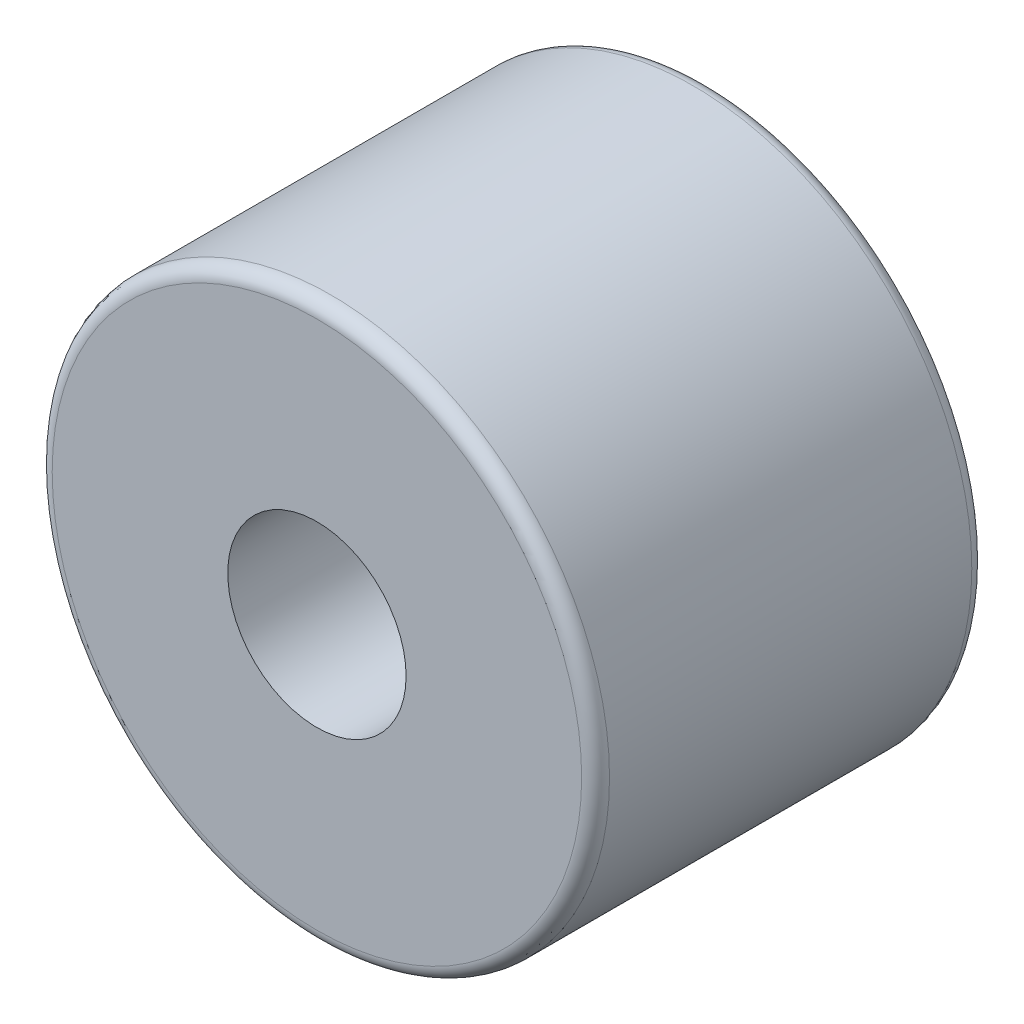
ISO-10303-21;
HEADER;
FILE_DESCRIPTION(('STEP AP214'),'2;1');
FILE_NAME('part.step','',(''),(''),'','','');
FILE_SCHEMA(('AUTOMOTIVE_DESIGN { 1 0 10303 214 1 1 1 1 }'));
ENDSEC;
DATA;
#1=APPLICATION_CONTEXT('core data for automotive mechanical design processes');
#2=APPLICATION_PROTOCOL_DEFINITION('international standard','automotive_design',2000,#1);
#3=PRODUCT_CONTEXT('',#1,'mechanical');
#4=PRODUCT('Part','Part','',(#3));
#5=PRODUCT_RELATED_PRODUCT_CATEGORY('part','',(#4));
#6=PRODUCT_DEFINITION_FORMATION('','',#4);
#7=PRODUCT_DEFINITION_CONTEXT('part definition',#1,'design');
#8=PRODUCT_DEFINITION('design','',#6,#7);
#9=PRODUCT_DEFINITION_SHAPE('','',#8);
#10=(LENGTH_UNIT() NAMED_UNIT(*) SI_UNIT(.MILLI.,.METRE.));
#11=(NAMED_UNIT(*) PLANE_ANGLE_UNIT() SI_UNIT($,.RADIAN.));
#12=(NAMED_UNIT(*) SI_UNIT($,.STERADIAN.) SOLID_ANGLE_UNIT());
#13=UNCERTAINTY_MEASURE_WITH_UNIT(LENGTH_MEASURE(1.E-05),#10,'distance_accuracy_value','');
#14=(GEOMETRIC_REPRESENTATION_CONTEXT(3) GLOBAL_UNCERTAINTY_ASSIGNED_CONTEXT((#13)) GLOBAL_UNIT_ASSIGNED_CONTEXT((#10,
#11,#12)) REPRESENTATION_CONTEXT('',''));
#15=CARTESIAN_POINT('',(0.,0.,0.));
#16=DIRECTION('',(0.,0.,1.));
#17=DIRECTION('',(1.,0.,0.));
#18=AXIS2_PLACEMENT_3D('',#15,#16,#17);
#19=CARTESIAN_POINT('',(0.,0.,7.));
#20=DIRECTION('',(0.,0.,1.));
#21=DIRECTION('',(1.,0.,0.));
#22=AXIS2_PLACEMENT_3D('',#19,#20,#21);
#23=PLANE('',#22);
#24=CARTESIAN_POINT('',(0.,0.,7.));
#25=DIRECTION('',(0.,0.,1.));
#26=DIRECTION('',(1.,0.,0.));
#27=AXIS2_PLACEMENT_3D('',#24,#25,#26);
#28=CIRCLE('',#27,4.75);
#29=CARTESIAN_POINT('',(4.75,0.,7.));
#30=VERTEX_POINT('',#29);
#31=EDGE_CURVE('E55',#30,#30,#28,.T.);
#32=ORIENTED_EDGE('',*,*,#31,.T.);
#33=EDGE_LOOP('',(#32));
#34=FACE_BOUND('',#33,.T.);
#35=CARTESIAN_POINT('',(0.,0.,7.));
#36=DIRECTION('',(0.,0.,1.));
#37=DIRECTION('',(1.,0.,0.));
#38=AXIS2_PLACEMENT_3D('',#35,#36,#37);
#39=CIRCLE('',#38,1.6);
#40=CARTESIAN_POINT('',(1.6,0.,7.));
#41=VERTEX_POINT('',#40);
#42=EDGE_CURVE('E60',#41,#41,#39,.T.);
#43=ORIENTED_EDGE('',*,*,#42,.F.);
#44=EDGE_LOOP('',(#43));
#45=FACE_BOUND('',#44,.T.);
#46=ADVANCED_FACE('F35',(#34,#45),#23,.T.);
#47=CARTESIAN_POINT('',(0.,0.,0.));
#48=DIRECTION('',(0.,0.,1.));
#49=DIRECTION('',(1.,0.,0.));
#50=AXIS2_PLACEMENT_3D('',#47,#48,#49);
#51=PLANE('',#50);
#52=CARTESIAN_POINT('',(0.,0.,0.));
#53=DIRECTION('',(0.,0.,1.));
#54=DIRECTION('',(1.,0.,0.));
#55=AXIS2_PLACEMENT_3D('',#52,#53,#54);
#56=CIRCLE('',#55,4.75);
#57=CARTESIAN_POINT('',(4.75,0.,0.));
#58=VERTEX_POINT('',#57);
#59=EDGE_CURVE('E10',#58,#58,#56,.F.);
#60=ORIENTED_EDGE('',*,*,#59,.T.);
#61=EDGE_LOOP('',(#60));
#62=FACE_BOUND('',#61,.T.);
#63=CARTESIAN_POINT('',(0.,0.,0.));
#64=DIRECTION('',(0.,0.,1.));
#65=DIRECTION('',(1.,0.,0.));
#66=AXIS2_PLACEMENT_3D('',#63,#64,#65);
#67=CIRCLE('',#66,1.6);
#68=CARTESIAN_POINT('',(1.6,0.,0.));
#69=VERTEX_POINT('',#68);
#70=EDGE_CURVE('E61',#69,#69,#67,.T.);
#71=ORIENTED_EDGE('',*,*,#70,.T.);
#72=EDGE_LOOP('',(#71));
#73=FACE_BOUND('',#72,.T.);
#74=ADVANCED_FACE('F72',(#62,#73),#51,.F.);
#75=CARTESIAN_POINT('',(0.,0.,7.));
#76=DIRECTION('',(0.,0.,-1.));
#77=DIRECTION('',(-1.,0.,0.));
#78=AXIS2_PLACEMENT_3D('',#75,#76,#77);
#79=CYLINDRICAL_SURFACE('',#78,5.);
#80=CARTESIAN_POINT('',(0.,0.,0.25));
#81=DIRECTION('',(0.,0.,1.));
#82=DIRECTION('',(1.,0.,0.));
#83=AXIS2_PLACEMENT_3D('',#80,#81,#82);
#84=CIRCLE('',#83,5.);
#85=CARTESIAN_POINT('',(5.,0.,0.25));
#86=VERTEX_POINT('',#85);
#87=EDGE_CURVE('E43',#86,#86,#84,.T.);
#88=ORIENTED_EDGE('',*,*,#87,.T.);
#89=EDGE_LOOP('',(#88));
#90=FACE_BOUND('',#89,.T.);
#91=CARTESIAN_POINT('',(0.,0.,6.75));
#92=DIRECTION('',(0.,0.,1.));
#93=DIRECTION('',(1.,0.,0.));
#94=AXIS2_PLACEMENT_3D('',#91,#92,#93);
#95=CIRCLE('',#94,5.);
#96=CARTESIAN_POINT('',(5.,0.,6.75));
#97=VERTEX_POINT('',#96);
#98=EDGE_CURVE('E49',#97,#97,#95,.F.);
#99=ORIENTED_EDGE('',*,*,#98,.T.);
#100=EDGE_LOOP('',(#99));
#101=FACE_BOUND('',#100,.T.);
#102=ADVANCED_FACE('F78',(#90,#101),#79,.T.);
#103=CARTESIAN_POINT('',(0.,0.,7.));
#104=DIRECTION('',(0.,0.,-1.));
#105=DIRECTION('',(-1.,0.,0.));
#106=AXIS2_PLACEMENT_3D('',#103,#104,#105);
#107=CYLINDRICAL_SURFACE('',#106,1.6);
#108=ORIENTED_EDGE('',*,*,#42,.T.);
#109=EDGE_LOOP('',(#108));
#110=FACE_BOUND('',#109,.T.);
#111=ORIENTED_EDGE('',*,*,#70,.F.);
#112=EDGE_LOOP('',(#111));
#113=FACE_BOUND('',#112,.T.);
#114=ADVANCED_FACE('F68',(#110,#113),#107,.F.);
#115=CARTESIAN_POINT('',(0.,0.,6.75));
#116=DIRECTION('',(0.,0.,1.));
#117=DIRECTION('',(1.,0.,0.));
#118=AXIS2_PLACEMENT_3D('',#115,#116,#117);
#119=TOROIDAL_SURFACE('',#118,4.75,0.25);
#120=ORIENTED_EDGE('',*,*,#98,.F.);
#121=EDGE_LOOP('',(#120));
#122=FACE_BOUND('',#121,.T.);
#123=ORIENTED_EDGE('',*,*,#31,.F.);
#124=EDGE_LOOP('',(#123));
#125=FACE_BOUND('',#124,.T.);
#126=ADVANCED_FACE('F83',(#122,#125),#119,.T.);
#127=CARTESIAN_POINT('',(0.,0.,0.25));
#128=DIRECTION('',(0.,0.,1.));
#129=DIRECTION('',(1.,0.,0.));
#130=AXIS2_PLACEMENT_3D('',#127,#128,#129);
#131=TOROIDAL_SURFACE('',#130,4.75,0.25);
#132=ORIENTED_EDGE('',*,*,#59,.F.);
#133=EDGE_LOOP('',(#132));
#134=FACE_BOUND('',#133,.T.);
#135=ORIENTED_EDGE('',*,*,#87,.F.);
#136=EDGE_LOOP('',(#135));
#137=FACE_BOUND('',#136,.T.);
#138=ADVANCED_FACE('F37',(#134,#137),#131,.T.);
#139=CLOSED_SHELL('',(#46,#74,#102,#114,#126,#138));
#140=MANIFOLD_SOLID_BREP('B2',#139);
#141=ADVANCED_BREP_SHAPE_REPRESENTATION('',(#18,#140),#14);
#142=SHAPE_DEFINITION_REPRESENTATION(#9,#141);
ENDSEC;
END-ISO-10303-21;
